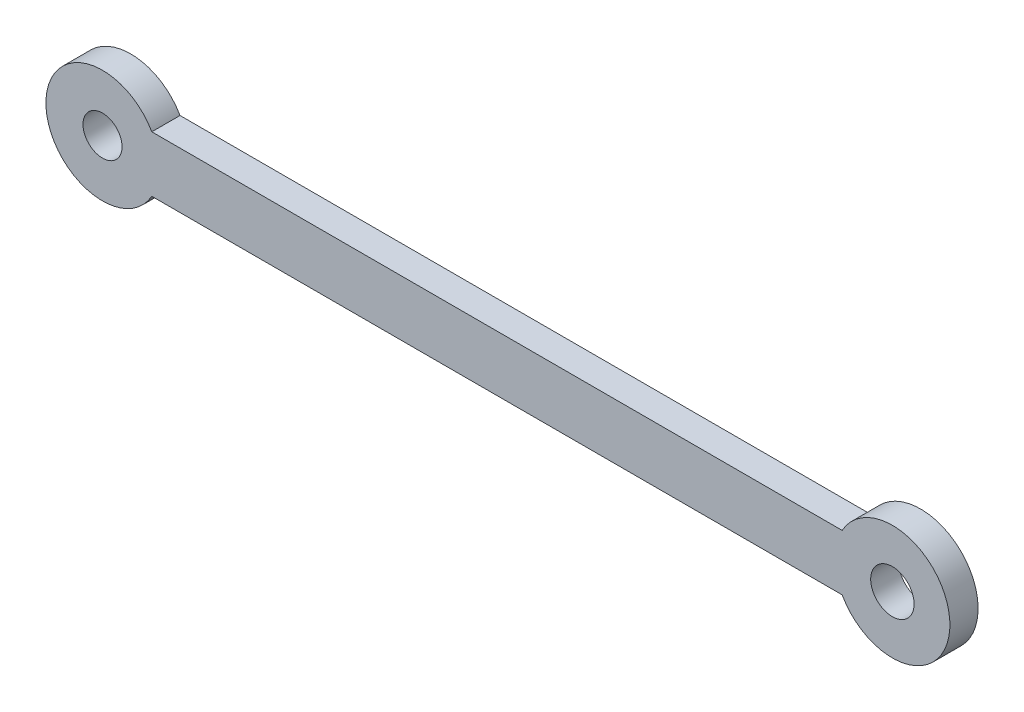
ISO-10303-21;
HEADER;
FILE_DESCRIPTION(('STEP AP214'),'2;1');
FILE_NAME('part.step','',(''),(''),'','','');
FILE_SCHEMA(('AUTOMOTIVE_DESIGN { 1 0 10303 214 1 1 1 1 }'));
ENDSEC;
DATA;
#1=APPLICATION_CONTEXT('core data for automotive mechanical design processes');
#2=APPLICATION_PROTOCOL_DEFINITION('international standard','automotive_design',2000,#1);
#3=PRODUCT_CONTEXT('',#1,'mechanical');
#4=PRODUCT('Part','Part','',(#3));
#5=PRODUCT_RELATED_PRODUCT_CATEGORY('part','',(#4));
#6=PRODUCT_DEFINITION_FORMATION('','',#4);
#7=PRODUCT_DEFINITION_CONTEXT('part definition',#1,'design');
#8=PRODUCT_DEFINITION('design','',#6,#7);
#9=PRODUCT_DEFINITION_SHAPE('','',#8);
#10=(LENGTH_UNIT() NAMED_UNIT(*) SI_UNIT(.MILLI.,.METRE.));
#11=(NAMED_UNIT(*) PLANE_ANGLE_UNIT() SI_UNIT($,.RADIAN.));
#12=(NAMED_UNIT(*) SI_UNIT($,.STERADIAN.) SOLID_ANGLE_UNIT());
#13=UNCERTAINTY_MEASURE_WITH_UNIT(LENGTH_MEASURE(1.E-05),#10,'distance_accuracy_value','');
#14=(GEOMETRIC_REPRESENTATION_CONTEXT(3) GLOBAL_UNCERTAINTY_ASSIGNED_CONTEXT((#13)) GLOBAL_UNIT_ASSIGNED_CONTEXT((#10,
#11,#12)) REPRESENTATION_CONTEXT('',''));
#15=CARTESIAN_POINT('',(0.,0.,0.));
#16=DIRECTION('',(0.,0.,1.));
#17=DIRECTION('',(1.,0.,0.));
#18=AXIS2_PLACEMENT_3D('',#15,#16,#17);
#19=CARTESIAN_POINT('',(-57.5130085185185,14.5859636371203,3.175));
#20=DIRECTION('',(0.,0.,1.));
#21=DIRECTION('',(1.,0.,0.));
#22=AXIS2_PLACEMENT_3D('',#19,#20,#21);
#23=PLANE('',#22);
#24=CARTESIAN_POINT('',(-57.5130085185185,14.5859636371203,3.175));
#25=DIRECTION('',(0.,0.,1.));
#26=DIRECTION('',(1.,0.,0.));
#27=AXIS2_PLACEMENT_3D('',#24,#25,#26);
#28=CIRCLE('',#27,2.19347965021128);
#29=CARTESIAN_POINT('',(-55.3195288683073,14.5859636371203,3.175));
#30=VERTEX_POINT('',#29);
#31=EDGE_CURVE('E101',#30,#30,#28,.T.);
#32=ORIENTED_EDGE('',*,*,#31,.F.);
#33=EDGE_LOOP('',(#32));
#34=FACE_BOUND('',#33,.T.);
#35=CARTESIAN_POINT('',(-57.5130085185185,14.5859636371203,3.175));
#36=DIRECTION('',(0.,0.,1.));
#37=DIRECTION('',(1.,0.,0.));
#38=AXIS2_PLACEMENT_3D('',#35,#36,#37);
#39=CIRCLE('',#38,6.36647389362948);
#40=CARTESIAN_POINT('',(-51.9740349854349,17.7247153058677,3.175));
#41=VERTEX_POINT('',#40);
#42=CARTESIAN_POINT('',(-51.9740349854349,11.4472119683729,3.175));
#43=VERTEX_POINT('',#42);
#44=EDGE_CURVE('E86',#41,#43,#39,.T.);
#45=ORIENTED_EDGE('',*,*,#44,.T.);
#46=DIRECTION('',(1.,0.,0.));
#47=VECTOR('',#46,1.);
#48=CARTESIAN_POINT('',(25.6465336358291,11.4472119683729,3.175));
#49=LINE('',#48,#47);
#50=CARTESIAN_POINT('',(25.6465336358291,11.4472119683729,3.175));
#51=VERTEX_POINT('',#50);
#52=EDGE_CURVE('E81',#43,#51,#49,.T.);
#53=ORIENTED_EDGE('',*,*,#52,.T.);
#54=CARTESIAN_POINT('',(31.2952004619226,14.5859636371203,3.175));
#55=DIRECTION('',(0.,0.,1.));
#56=DIRECTION('',(1.,0.,0.));
#57=AXIS2_PLACEMENT_3D('',#54,#55,#56);
#58=CIRCLE('',#57,6.46213578859758);
#59=CARTESIAN_POINT('',(25.6465336358291,17.7247153058677,3.175));
#60=VERTEX_POINT('',#59);
#61=EDGE_CURVE('E84',#51,#60,#58,.T.);
#62=ORIENTED_EDGE('',*,*,#61,.T.);
#63=DIRECTION('',(-1.,0.,0.));
#64=VECTOR('',#63,1.);
#65=CARTESIAN_POINT('',(-51.9740349854349,17.7247153058677,3.175));
#66=LINE('',#65,#64);
#67=EDGE_CURVE('E51',#60,#41,#66,.T.);
#68=ORIENTED_EDGE('',*,*,#67,.T.);
#69=EDGE_LOOP('',(#45,#53,#62,#68));
#70=FACE_BOUND('',#69,.T.);
#71=CARTESIAN_POINT('',(31.2952004619226,14.5859636371203,3.175));
#72=DIRECTION('',(0.,0.,1.));
#73=DIRECTION('',(1.,0.,0.));
#74=AXIS2_PLACEMENT_3D('',#71,#72,#73);
#75=CIRCLE('',#74,2.44022940519207);
#76=CARTESIAN_POINT('',(33.7354298671147,14.5859636371203,3.175));
#77=VERTEX_POINT('',#76);
#78=EDGE_CURVE('E116',#77,#77,#75,.T.);
#79=ORIENTED_EDGE('',*,*,#78,.F.);
#80=EDGE_LOOP('',(#79));
#81=FACE_BOUND('',#80,.T.);
#82=ADVANCED_FACE('F34',(#34,#70,#81),#23,.T.);
#83=CARTESIAN_POINT('',(-57.5130085185185,14.5859636371203,0.));
#84=DIRECTION('',(0.,0.,1.));
#85=DIRECTION('',(1.,0.,0.));
#86=AXIS2_PLACEMENT_3D('',#83,#84,#85);
#87=PLANE('',#86);
#88=CARTESIAN_POINT('',(-57.5130085185185,14.5859636371203,0.));
#89=DIRECTION('',(0.,0.,1.));
#90=DIRECTION('',(1.,0.,0.));
#91=AXIS2_PLACEMENT_3D('',#88,#89,#90);
#92=CIRCLE('',#91,6.36647389362948);
#93=CARTESIAN_POINT('',(-51.9740349854349,17.7247153058677,0.));
#94=VERTEX_POINT('',#93);
#95=CARTESIAN_POINT('',(-51.9740349854349,11.4472119683729,0.));
#96=VERTEX_POINT('',#95);
#97=EDGE_CURVE('E98',#94,#96,#92,.T.);
#98=ORIENTED_EDGE('',*,*,#97,.F.);
#99=DIRECTION('',(-1.,0.,0.));
#100=VECTOR('',#99,1.);
#101=CARTESIAN_POINT('',(-51.9740349854349,17.7247153058677,0.));
#102=LINE('',#101,#100);
#103=CARTESIAN_POINT('',(25.6465336358291,17.7247153058677,0.));
#104=VERTEX_POINT('',#103);
#105=EDGE_CURVE('E74',#104,#94,#102,.T.);
#106=ORIENTED_EDGE('',*,*,#105,.F.);
#107=CARTESIAN_POINT('',(31.2952004619226,14.5859636371203,0.));
#108=DIRECTION('',(0.,0.,1.));
#109=DIRECTION('',(1.,0.,0.));
#110=AXIS2_PLACEMENT_3D('',#107,#108,#109);
#111=CIRCLE('',#110,6.46213578859758);
#112=CARTESIAN_POINT('',(25.6465336358291,11.4472119683729,0.));
#113=VERTEX_POINT('',#112);
#114=EDGE_CURVE('E68',#113,#104,#111,.T.);
#115=ORIENTED_EDGE('',*,*,#114,.F.);
#116=DIRECTION('',(1.,0.,0.));
#117=VECTOR('',#116,1.);
#118=CARTESIAN_POINT('',(25.6465336358291,11.4472119683729,0.));
#119=LINE('',#118,#117);
#120=EDGE_CURVE('E90',#96,#113,#119,.T.);
#121=ORIENTED_EDGE('',*,*,#120,.F.);
#122=EDGE_LOOP('',(#98,#106,#115,#121));
#123=FACE_BOUND('',#122,.T.);
#124=CARTESIAN_POINT('',(-57.5130085185185,14.5859636371203,0.));
#125=DIRECTION('',(0.,0.,1.));
#126=DIRECTION('',(1.,0.,0.));
#127=AXIS2_PLACEMENT_3D('',#124,#125,#126);
#128=CIRCLE('',#127,2.19347965021128);
#129=CARTESIAN_POINT('',(-55.3195288683073,14.5859636371203,0.));
#130=VERTEX_POINT('',#129);
#131=EDGE_CURVE('E113',#130,#130,#128,.T.);
#132=ORIENTED_EDGE('',*,*,#131,.T.);
#133=EDGE_LOOP('',(#132));
#134=FACE_BOUND('',#133,.T.);
#135=CARTESIAN_POINT('',(31.2952004619226,14.5859636371203,0.));
#136=DIRECTION('',(0.,0.,1.));
#137=DIRECTION('',(1.,0.,0.));
#138=AXIS2_PLACEMENT_3D('',#135,#136,#137);
#139=CIRCLE('',#138,2.44022940519207);
#140=CARTESIAN_POINT('',(33.7354298671147,14.5859636371203,0.));
#141=VERTEX_POINT('',#140);
#142=EDGE_CURVE('E119',#141,#141,#139,.T.);
#143=ORIENTED_EDGE('',*,*,#142,.T.);
#144=EDGE_LOOP('',(#143));
#145=FACE_BOUND('',#144,.T.);
#146=ADVANCED_FACE('F109',(#123,#134,#145),#87,.F.);
#147=CARTESIAN_POINT('',(-57.5130085185185,14.5859636371203,3.175));
#148=DIRECTION('',(0.,0.,-1.));
#149=DIRECTION('',(-1.,0.,0.));
#150=AXIS2_PLACEMENT_3D('',#147,#148,#149);
#151=CYLINDRICAL_SURFACE('',#150,6.36647389362948);
#152=ORIENTED_EDGE('',*,*,#97,.T.);
#153=DIRECTION('',(0.,0.,-1.));
#154=VECTOR('',#153,1.);
#155=CARTESIAN_POINT('',(-51.9740349854349,11.4472119683729,3.175));
#156=LINE('',#155,#154);
#157=EDGE_CURVE('E11',#43,#96,#156,.T.);
#158=ORIENTED_EDGE('',*,*,#157,.F.);
#159=ORIENTED_EDGE('',*,*,#44,.F.);
#160=DIRECTION('',(0.,0.,-1.));
#161=VECTOR('',#160,1.);
#162=CARTESIAN_POINT('',(-51.9740349854349,17.7247153058677,3.175));
#163=LINE('',#162,#161);
#164=EDGE_CURVE('E94',#41,#94,#163,.T.);
#165=ORIENTED_EDGE('',*,*,#164,.T.);
#166=EDGE_LOOP('',(#152,#158,#159,#165));
#167=FACE_BOUND('',#166,.T.);
#168=ADVANCED_FACE('F36',(#167),#151,.T.);
#169=CARTESIAN_POINT('',(25.6465336358291,11.4472119683729,3.175));
#170=DIRECTION('',(0.,1.,0.));
#171=DIRECTION('',(0.,0.,1.));
#172=AXIS2_PLACEMENT_3D('',#169,#170,#171);
#173=PLANE('',#172);
#174=ORIENTED_EDGE('',*,*,#120,.T.);
#175=DIRECTION('',(0.,0.,-1.));
#176=VECTOR('',#175,1.);
#177=CARTESIAN_POINT('',(25.6465336358291,11.4472119683729,3.175));
#178=LINE('',#177,#176);
#179=EDGE_CURVE('E43',#51,#113,#178,.T.);
#180=ORIENTED_EDGE('',*,*,#179,.F.);
#181=ORIENTED_EDGE('',*,*,#52,.F.);
#182=ORIENTED_EDGE('',*,*,#157,.T.);
#183=EDGE_LOOP('',(#174,#180,#181,#182));
#184=FACE_BOUND('',#183,.T.);
#185=ADVANCED_FACE('F89',(#184),#173,.F.);
#186=CARTESIAN_POINT('',(31.2952004619226,14.5859636371203,3.175));
#187=DIRECTION('',(0.,0.,-1.));
#188=DIRECTION('',(-1.,0.,0.));
#189=AXIS2_PLACEMENT_3D('',#186,#187,#188);
#190=CYLINDRICAL_SURFACE('',#189,6.46213578859758);
#191=ORIENTED_EDGE('',*,*,#114,.T.);
#192=DIRECTION('',(0.,0.,-1.));
#193=VECTOR('',#192,1.);
#194=CARTESIAN_POINT('',(25.6465336358291,17.7247153058677,3.175));
#195=LINE('',#194,#193);
#196=EDGE_CURVE('E91',#60,#104,#195,.T.);
#197=ORIENTED_EDGE('',*,*,#196,.F.);
#198=ORIENTED_EDGE('',*,*,#61,.F.);
#199=ORIENTED_EDGE('',*,*,#179,.T.);
#200=EDGE_LOOP('',(#191,#197,#198,#199));
#201=FACE_BOUND('',#200,.T.);
#202=ADVANCED_FACE('F92',(#201),#190,.T.);
#203=CARTESIAN_POINT('',(-51.9740349854349,17.7247153058677,3.175));
#204=DIRECTION('',(0.,-1.,0.));
#205=DIRECTION('',(0.,0.,-1.));
#206=AXIS2_PLACEMENT_3D('',#203,#204,#205);
#207=PLANE('',#206);
#208=ORIENTED_EDGE('',*,*,#105,.T.);
#209=ORIENTED_EDGE('',*,*,#164,.F.);
#210=ORIENTED_EDGE('',*,*,#67,.F.);
#211=ORIENTED_EDGE('',*,*,#196,.T.);
#212=EDGE_LOOP('',(#208,#209,#210,#211));
#213=FACE_BOUND('',#212,.T.);
#214=ADVANCED_FACE('F106',(#213),#207,.F.);
#215=CARTESIAN_POINT('',(-57.5130085185185,14.5859636371203,3.175));
#216=DIRECTION('',(0.,0.,-1.));
#217=DIRECTION('',(-1.,0.,0.));
#218=AXIS2_PLACEMENT_3D('',#215,#216,#217);
#219=CYLINDRICAL_SURFACE('',#218,2.19347965021128);
#220=ORIENTED_EDGE('',*,*,#31,.T.);
#221=EDGE_LOOP('',(#220));
#222=FACE_BOUND('',#221,.T.);
#223=ORIENTED_EDGE('',*,*,#131,.F.);
#224=EDGE_LOOP('',(#223));
#225=FACE_BOUND('',#224,.T.);
#226=ADVANCED_FACE('F136',(#222,#225),#219,.F.);
#227=CARTESIAN_POINT('',(31.2952004619226,14.5859636371203,3.175));
#228=DIRECTION('',(0.,0.,-1.));
#229=DIRECTION('',(-1.,0.,0.));
#230=AXIS2_PLACEMENT_3D('',#227,#228,#229);
#231=CYLINDRICAL_SURFACE('',#230,2.44022940519207);
#232=ORIENTED_EDGE('',*,*,#78,.T.);
#233=EDGE_LOOP('',(#232));
#234=FACE_BOUND('',#233,.T.);
#235=ORIENTED_EDGE('',*,*,#142,.F.);
#236=EDGE_LOOP('',(#235));
#237=FACE_BOUND('',#236,.T.);
#238=ADVANCED_FACE('F125',(#234,#237),#231,.F.);
#239=CLOSED_SHELL('',(#82,#146,#168,#185,#202,#214,#226,#238));
#240=MANIFOLD_SOLID_BREP('B2',#239);
#241=ADVANCED_BREP_SHAPE_REPRESENTATION('',(#18,#240),#14);
#242=SHAPE_DEFINITION_REPRESENTATION(#9,#241);
ENDSEC;
END-ISO-10303-21;
